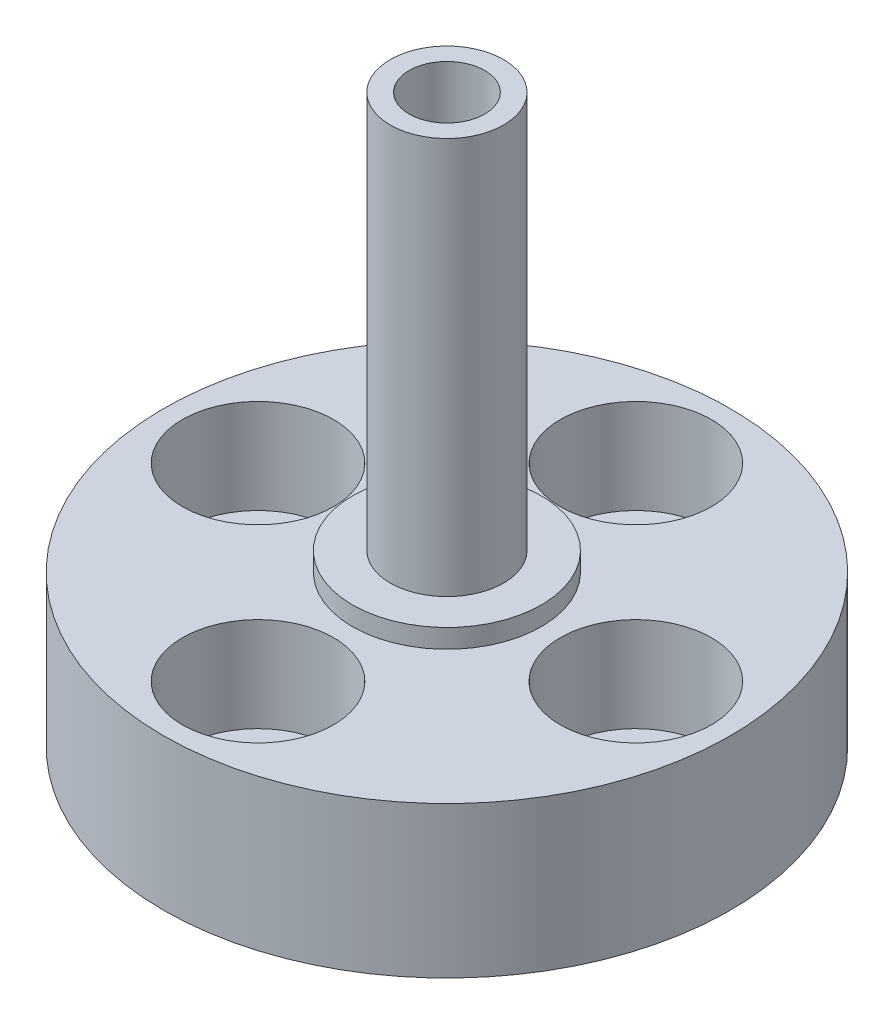
ISO-10303-21;
HEADER;
FILE_DESCRIPTION(('STEP AP214'),'2;1');
FILE_NAME('part.step','',(''),(''),'','','');
FILE_SCHEMA(('AUTOMOTIVE_DESIGN { 1 0 10303 214 1 1 1 1 }'));
ENDSEC;
DATA;
#1=APPLICATION_CONTEXT('core data for automotive mechanical design processes');
#2=APPLICATION_PROTOCOL_DEFINITION('international standard','automotive_design',2000,#1);
#3=PRODUCT_CONTEXT('',#1,'mechanical');
#4=PRODUCT('Part','Part','',(#3));
#5=PRODUCT_RELATED_PRODUCT_CATEGORY('part','',(#4));
#6=PRODUCT_DEFINITION_FORMATION('','',#4);
#7=PRODUCT_DEFINITION_CONTEXT('part definition',#1,'design');
#8=PRODUCT_DEFINITION('design','',#6,#7);
#9=PRODUCT_DEFINITION_SHAPE('','',#8);
#10=(LENGTH_UNIT() NAMED_UNIT(*) SI_UNIT(.MILLI.,.METRE.));
#11=(NAMED_UNIT(*) PLANE_ANGLE_UNIT() SI_UNIT($,.RADIAN.));
#12=(NAMED_UNIT(*) SI_UNIT($,.STERADIAN.) SOLID_ANGLE_UNIT());
#13=UNCERTAINTY_MEASURE_WITH_UNIT(LENGTH_MEASURE(1.E-05),#10,'distance_accuracy_value','');
#14=(GEOMETRIC_REPRESENTATION_CONTEXT(3) GLOBAL_UNCERTAINTY_ASSIGNED_CONTEXT((#13)) GLOBAL_UNIT_ASSIGNED_CONTEXT((#10,
#11,#12)) REPRESENTATION_CONTEXT('',''));
#15=CARTESIAN_POINT('',(0.,0.,0.));
#16=DIRECTION('',(0.,0.,1.));
#17=DIRECTION('',(1.,0.,0.));
#18=AXIS2_PLACEMENT_3D('',#15,#16,#17);
#19=CARTESIAN_POINT('',(0.,8.,0.));
#20=DIRECTION('',(0.,-1.,0.));
#21=DIRECTION('',(0.,0.,-1.));
#22=AXIS2_PLACEMENT_3D('',#19,#20,#21);
#23=CYLINDRICAL_SURFACE('',#22,15.);
#24=CARTESIAN_POINT('',(0.,8.,0.));
#25=DIRECTION('',(0.,1.,0.));
#26=DIRECTION('',(0.,0.,1.));
#27=AXIS2_PLACEMENT_3D('',#24,#25,#26);
#28=CIRCLE('',#27,15.);
#29=CARTESIAN_POINT('',(0.,8.,15.));
#30=VERTEX_POINT('',#29);
#31=EDGE_CURVE('E57',#30,#30,#28,.T.);
#32=ORIENTED_EDGE('',*,*,#31,.F.);
#33=EDGE_LOOP('',(#32));
#34=FACE_BOUND('',#33,.T.);
#35=CARTESIAN_POINT('',(0.,0.,0.));
#36=DIRECTION('',(0.,1.,0.));
#37=DIRECTION('',(0.,0.,1.));
#38=AXIS2_PLACEMENT_3D('',#35,#36,#37);
#39=CIRCLE('',#38,15.);
#40=CARTESIAN_POINT('',(0.,0.,15.));
#41=VERTEX_POINT('',#40);
#42=EDGE_CURVE('E46',#41,#41,#39,.T.);
#43=ORIENTED_EDGE('',*,*,#42,.T.);
#44=EDGE_LOOP('',(#43));
#45=FACE_BOUND('',#44,.T.);
#46=ADVANCED_FACE('F43',(#34,#45),#23,.T.);
#47=CARTESIAN_POINT('',(0.,8.,0.));
#48=DIRECTION('',(0.,1.,0.));
#49=DIRECTION('',(0.,0.,1.));
#50=AXIS2_PLACEMENT_3D('',#47,#48,#49);
#51=PLANE('',#50);
#52=CARTESIAN_POINT('',(-10.,8.,0.));
#53=DIRECTION('',(0.,1.,0.));
#54=DIRECTION('',(0.,0.,1.));
#55=AXIS2_PLACEMENT_3D('',#52,#53,#54);
#56=CIRCLE('',#55,4.00000000000001);
#57=CARTESIAN_POINT('',(-10.,8.,4.00000000000001));
#58=VERTEX_POINT('',#57);
#59=EDGE_CURVE('E287',#58,#58,#56,.T.);
#60=ORIENTED_EDGE('',*,*,#59,.F.);
#61=EDGE_LOOP('',(#60));
#62=FACE_BOUND('',#61,.T.);
#63=CARTESIAN_POINT('',(0.,8.,-10.));
#64=DIRECTION('',(0.,1.,0.));
#65=DIRECTION('',(0.,0.,1.));
#66=AXIS2_PLACEMENT_3D('',#63,#64,#65);
#67=CIRCLE('',#66,4.00000000000001);
#68=CARTESIAN_POINT('',(0.,8.,-5.99999999999999));
#69=VERTEX_POINT('',#68);
#70=EDGE_CURVE('E308',#69,#69,#67,.T.);
#71=ORIENTED_EDGE('',*,*,#70,.F.);
#72=EDGE_LOOP('',(#71));
#73=FACE_BOUND('',#72,.T.);
#74=CARTESIAN_POINT('',(10.,8.,0.));
#75=DIRECTION('',(0.,1.,0.));
#76=DIRECTION('',(0.,0.,1.));
#77=AXIS2_PLACEMENT_3D('',#74,#75,#76);
#78=CIRCLE('',#77,4.00000000000001);
#79=CARTESIAN_POINT('',(10.,8.,4.00000000000001));
#80=VERTEX_POINT('',#79);
#81=EDGE_CURVE('E324',#80,#80,#78,.T.);
#82=ORIENTED_EDGE('',*,*,#81,.F.);
#83=EDGE_LOOP('',(#82));
#84=FACE_BOUND('',#83,.T.);
#85=CARTESIAN_POINT('',(0.,8.,10.));
#86=DIRECTION('',(0.,1.,0.));
#87=DIRECTION('',(0.,0.,1.));
#88=AXIS2_PLACEMENT_3D('',#85,#86,#87);
#89=CIRCLE('',#88,4.00000000000001);
#90=CARTESIAN_POINT('',(0.,8.,14.));
#91=VERTEX_POINT('',#90);
#92=EDGE_CURVE('E340',#91,#91,#89,.T.);
#93=ORIENTED_EDGE('',*,*,#92,.F.);
#94=EDGE_LOOP('',(#93));
#95=FACE_BOUND('',#94,.T.);
#96=CARTESIAN_POINT('',(0.,8.,0.));
#97=DIRECTION('',(0.,1.,0.));
#98=DIRECTION('',(0.,0.,1.));
#99=AXIS2_PLACEMENT_3D('',#96,#97,#98);
#100=CIRCLE('',#99,5.);
#101=CARTESIAN_POINT('',(0.,8.,5.));
#102=VERTEX_POINT('',#101);
#103=EDGE_CURVE('E51',#102,#102,#100,.T.);
#104=ORIENTED_EDGE('',*,*,#103,.F.);
#105=EDGE_LOOP('',(#104));
#106=FACE_BOUND('',#105,.T.);
#107=ORIENTED_EDGE('',*,*,#31,.T.);
#108=EDGE_LOOP('',(#107));
#109=FACE_BOUND('',#108,.T.);
#110=ADVANCED_FACE('F78',(#62,#73,#84,#95,#106,#109),#51,.T.);
#111=CARTESIAN_POINT('',(0.,0.,0.));
#112=DIRECTION('',(0.,1.,0.));
#113=DIRECTION('',(0.,0.,1.));
#114=AXIS2_PLACEMENT_3D('',#111,#112,#113);
#115=PLANE('',#114);
#116=CARTESIAN_POINT('',(-10.,0.,0.));
#117=DIRECTION('',(0.,1.,0.));
#118=DIRECTION('',(0.,0.,1.));
#119=AXIS2_PLACEMENT_3D('',#116,#117,#118);
#120=CIRCLE('',#119,2.00000000000001);
#121=CARTESIAN_POINT('',(-10.,0.,2.00000000000001));
#122=VERTEX_POINT('',#121);
#123=EDGE_CURVE('E305',#122,#122,#120,.T.);
#124=ORIENTED_EDGE('',*,*,#123,.T.);
#125=EDGE_LOOP('',(#124));
#126=FACE_BOUND('',#125,.T.);
#127=CARTESIAN_POINT('',(0.,0.,-10.));
#128=DIRECTION('',(0.,1.,0.));
#129=DIRECTION('',(0.,0.,1.));
#130=AXIS2_PLACEMENT_3D('',#127,#128,#129);
#131=CIRCLE('',#130,2.00000000000001);
#132=CARTESIAN_POINT('',(0.,0.,-7.99999999999999));
#133=VERTEX_POINT('',#132);
#134=EDGE_CURVE('E320',#133,#133,#131,.T.);
#135=ORIENTED_EDGE('',*,*,#134,.T.);
#136=EDGE_LOOP('',(#135));
#137=FACE_BOUND('',#136,.T.);
#138=CARTESIAN_POINT('',(10.,0.,0.));
#139=DIRECTION('',(0.,1.,0.));
#140=DIRECTION('',(0.,0.,1.));
#141=AXIS2_PLACEMENT_3D('',#138,#139,#140);
#142=CIRCLE('',#141,2.00000000000001);
#143=CARTESIAN_POINT('',(10.,0.,2.00000000000001));
#144=VERTEX_POINT('',#143);
#145=EDGE_CURVE('E336',#144,#144,#142,.T.);
#146=ORIENTED_EDGE('',*,*,#145,.T.);
#147=EDGE_LOOP('',(#146));
#148=FACE_BOUND('',#147,.T.);
#149=CARTESIAN_POINT('',(0.,0.,10.));
#150=DIRECTION('',(0.,1.,0.));
#151=DIRECTION('',(0.,0.,1.));
#152=AXIS2_PLACEMENT_3D('',#149,#150,#151);
#153=CIRCLE('',#152,2.00000000000001);
#154=CARTESIAN_POINT('',(0.,0.,12.));
#155=VERTEX_POINT('',#154);
#156=EDGE_CURVE('E351',#155,#155,#153,.T.);
#157=ORIENTED_EDGE('',*,*,#156,.T.);
#158=EDGE_LOOP('',(#157));
#159=FACE_BOUND('',#158,.T.);
#160=ORIENTED_EDGE('',*,*,#42,.F.);
#161=EDGE_LOOP('',(#160));
#162=FACE_BOUND('',#161,.T.);
#163=ADVANCED_FACE('F75',(#126,#137,#148,#159,#162),#115,.F.);
#164=CARTESIAN_POINT('',(0.,9.,0.));
#165=DIRECTION('',(0.,-1.,0.));
#166=DIRECTION('',(0.,0.,-1.));
#167=AXIS2_PLACEMENT_3D('',#164,#165,#166);
#168=CYLINDRICAL_SURFACE('',#167,5.);
#169=CARTESIAN_POINT('',(0.,9.,0.));
#170=DIRECTION('',(0.,1.,0.));
#171=DIRECTION('',(0.,0.,1.));
#172=AXIS2_PLACEMENT_3D('',#169,#170,#171);
#173=CIRCLE('',#172,5.);
#174=CARTESIAN_POINT('',(0.,9.,5.));
#175=VERTEX_POINT('',#174);
#176=EDGE_CURVE('E63',#175,#175,#173,.T.);
#177=ORIENTED_EDGE('',*,*,#176,.F.);
#178=EDGE_LOOP('',(#177));
#179=FACE_BOUND('',#178,.T.);
#180=ORIENTED_EDGE('',*,*,#103,.T.);
#181=EDGE_LOOP('',(#180));
#182=FACE_BOUND('',#181,.T.);
#183=ADVANCED_FACE('F77',(#179,#182),#168,.T.);
#184=CARTESIAN_POINT('',(0.,9.,0.));
#185=DIRECTION('',(0.,1.,0.));
#186=DIRECTION('',(0.,0.,1.));
#187=AXIS2_PLACEMENT_3D('',#184,#185,#186);
#188=PLANE('',#187);
#189=CARTESIAN_POINT('',(0.,9.,0.));
#190=DIRECTION('',(0.,1.,0.));
#191=DIRECTION('',(0.,0.,1.));
#192=AXIS2_PLACEMENT_3D('',#189,#190,#191);
#193=CIRCLE('',#192,3.);
#194=CARTESIAN_POINT('',(0.,9.,3.));
#195=VERTEX_POINT('',#194);
#196=EDGE_CURVE('E10',#195,#195,#193,.T.);
#197=ORIENTED_EDGE('',*,*,#196,.F.);
#198=EDGE_LOOP('',(#197));
#199=FACE_BOUND('',#198,.T.);
#200=ORIENTED_EDGE('',*,*,#176,.T.);
#201=EDGE_LOOP('',(#200));
#202=FACE_BOUND('',#201,.T.);
#203=ADVANCED_FACE('F85',(#199,#202),#188,.T.);
#204=CARTESIAN_POINT('',(0.,30.,0.));
#205=DIRECTION('',(0.,-1.,0.));
#206=DIRECTION('',(0.,0.,-1.));
#207=AXIS2_PLACEMENT_3D('',#204,#205,#206);
#208=CYLINDRICAL_SURFACE('',#207,3.);
#209=CARTESIAN_POINT('',(0.,30.,0.));
#210=DIRECTION('',(0.,1.,0.));
#211=DIRECTION('',(0.,0.,1.));
#212=AXIS2_PLACEMENT_3D('',#209,#210,#211);
#213=CIRCLE('',#212,3.);
#214=CARTESIAN_POINT('',(0.,30.,3.));
#215=VERTEX_POINT('',#214);
#216=EDGE_CURVE('E61',#215,#215,#213,.T.);
#217=ORIENTED_EDGE('',*,*,#216,.F.);
#218=EDGE_LOOP('',(#217));
#219=FACE_BOUND('',#218,.T.);
#220=ORIENTED_EDGE('',*,*,#196,.T.);
#221=EDGE_LOOP('',(#220));
#222=FACE_BOUND('',#221,.T.);
#223=ADVANCED_FACE('F109',(#219,#222),#208,.T.);
#224=CARTESIAN_POINT('',(0.,30.,0.));
#225=DIRECTION('',(0.,1.,0.));
#226=DIRECTION('',(0.,0.,1.));
#227=AXIS2_PLACEMENT_3D('',#224,#225,#226);
#228=PLANE('',#227);
#229=CARTESIAN_POINT('',(0.,30.,0.));
#230=DIRECTION('',(0.,1.,0.));
#231=DIRECTION('',(0.,0.,1.));
#232=AXIS2_PLACEMENT_3D('',#229,#230,#231);
#233=CIRCLE('',#232,2.);
#234=CARTESIAN_POINT('',(0.,30.,2.));
#235=VERTEX_POINT('',#234);
#236=EDGE_CURVE('E288',#235,#235,#233,.T.);
#237=ORIENTED_EDGE('',*,*,#236,.F.);
#238=EDGE_LOOP('',(#237));
#239=FACE_BOUND('',#238,.T.);
#240=ORIENTED_EDGE('',*,*,#216,.T.);
#241=EDGE_LOOP('',(#240));
#242=FACE_BOUND('',#241,.T.);
#243=ADVANCED_FACE('F117',(#239,#242),#228,.T.);
#244=CARTESIAN_POINT('',(0.,8.,10.));
#245=DIRECTION('',(0.,1.,0.));
#246=DIRECTION('',(0.,0.,1.));
#247=AXIS2_PLACEMENT_3D('',#244,#245,#246);
#248=CYLINDRICAL_SURFACE('',#247,2.00000000000001);
#249=ORIENTED_EDGE('',*,*,#156,.F.);
#250=EDGE_LOOP('',(#249));
#251=FACE_BOUND('',#250,.T.);
#252=CARTESIAN_POINT('',(0.,3.,10.));
#253=DIRECTION('',(0.,1.,0.));
#254=DIRECTION('',(0.,0.,1.));
#255=AXIS2_PLACEMENT_3D('',#252,#253,#254);
#256=CIRCLE('',#255,2.00000000000001);
#257=CARTESIAN_POINT('',(0.,3.,12.));
#258=VERTEX_POINT('',#257);
#259=EDGE_CURVE('E348',#258,#258,#256,.T.);
#260=ORIENTED_EDGE('',*,*,#259,.T.);
#261=EDGE_LOOP('',(#260));
#262=FACE_BOUND('',#261,.T.);
#263=ADVANCED_FACE('F140',(#251,#262),#248,.F.);
#264=CARTESIAN_POINT('',(2.00000000000001,3.,10.));
#265=DIRECTION('',(0.,-1.,0.));
#266=DIRECTION('',(0.,0.,-1.));
#267=AXIS2_PLACEMENT_3D('',#264,#265,#266);
#268=PLANE('',#267);
#269=ORIENTED_EDGE('',*,*,#259,.F.);
#270=EDGE_LOOP('',(#269));
#271=FACE_BOUND('',#270,.T.);
#272=CARTESIAN_POINT('',(0.,3.,10.));
#273=DIRECTION('',(0.,1.,0.));
#274=DIRECTION('',(0.,0.,1.));
#275=AXIS2_PLACEMENT_3D('',#272,#273,#274);
#276=CIRCLE('',#275,4.00000000000001);
#277=CARTESIAN_POINT('',(0.,3.,14.));
#278=VERTEX_POINT('',#277);
#279=EDGE_CURVE('E344',#278,#278,#276,.T.);
#280=ORIENTED_EDGE('',*,*,#279,.T.);
#281=EDGE_LOOP('',(#280));
#282=FACE_BOUND('',#281,.T.);
#283=ADVANCED_FACE('F148',(#271,#282),#268,.F.);
#284=CARTESIAN_POINT('',(0.,8.,10.));
#285=DIRECTION('',(0.,1.,0.));
#286=DIRECTION('',(0.,0.,1.));
#287=AXIS2_PLACEMENT_3D('',#284,#285,#286);
#288=CYLINDRICAL_SURFACE('',#287,4.00000000000001);
#289=ORIENTED_EDGE('',*,*,#279,.F.);
#290=EDGE_LOOP('',(#289));
#291=FACE_BOUND('',#290,.T.);
#292=ORIENTED_EDGE('',*,*,#92,.T.);
#293=EDGE_LOOP('',(#292));
#294=FACE_BOUND('',#293,.T.);
#295=ADVANCED_FACE('F157',(#291,#294),#288,.F.);
#296=CARTESIAN_POINT('',(10.,8.,0.));
#297=DIRECTION('',(0.,1.,0.));
#298=DIRECTION('',(0.,0.,1.));
#299=AXIS2_PLACEMENT_3D('',#296,#297,#298);
#300=CYLINDRICAL_SURFACE('',#299,2.00000000000001);
#301=ORIENTED_EDGE('',*,*,#145,.F.);
#302=EDGE_LOOP('',(#301));
#303=FACE_BOUND('',#302,.T.);
#304=CARTESIAN_POINT('',(10.,3.,0.));
#305=DIRECTION('',(0.,1.,0.));
#306=DIRECTION('',(0.,0.,1.));
#307=AXIS2_PLACEMENT_3D('',#304,#305,#306);
#308=CIRCLE('',#307,2.00000000000001);
#309=CARTESIAN_POINT('',(10.,3.,2.00000000000001));
#310=VERTEX_POINT('',#309);
#311=EDGE_CURVE('E332',#310,#310,#308,.T.);
#312=ORIENTED_EDGE('',*,*,#311,.T.);
#313=EDGE_LOOP('',(#312));
#314=FACE_BOUND('',#313,.T.);
#315=ADVANCED_FACE('F166',(#303,#314),#300,.F.);
#316=CARTESIAN_POINT('',(12.,3.,0.));
#317=DIRECTION('',(0.,-1.,0.));
#318=DIRECTION('',(0.,0.,-1.));
#319=AXIS2_PLACEMENT_3D('',#316,#317,#318);
#320=PLANE('',#319);
#321=ORIENTED_EDGE('',*,*,#311,.F.);
#322=EDGE_LOOP('',(#321));
#323=FACE_BOUND('',#322,.T.);
#324=CARTESIAN_POINT('',(10.,3.,0.));
#325=DIRECTION('',(0.,1.,0.));
#326=DIRECTION('',(0.,0.,1.));
#327=AXIS2_PLACEMENT_3D('',#324,#325,#326);
#328=CIRCLE('',#327,4.00000000000001);
#329=CARTESIAN_POINT('',(10.,3.,4.00000000000001));
#330=VERTEX_POINT('',#329);
#331=EDGE_CURVE('E328',#330,#330,#328,.T.);
#332=ORIENTED_EDGE('',*,*,#331,.T.);
#333=EDGE_LOOP('',(#332));
#334=FACE_BOUND('',#333,.T.);
#335=ADVANCED_FACE('F175',(#323,#334),#320,.F.);
#336=CARTESIAN_POINT('',(10.,8.,0.));
#337=DIRECTION('',(0.,1.,0.));
#338=DIRECTION('',(0.,0.,1.));
#339=AXIS2_PLACEMENT_3D('',#336,#337,#338);
#340=CYLINDRICAL_SURFACE('',#339,4.00000000000001);
#341=ORIENTED_EDGE('',*,*,#331,.F.);
#342=EDGE_LOOP('',(#341));
#343=FACE_BOUND('',#342,.T.);
#344=ORIENTED_EDGE('',*,*,#81,.T.);
#345=EDGE_LOOP('',(#344));
#346=FACE_BOUND('',#345,.T.);
#347=ADVANCED_FACE('F184',(#343,#346),#340,.F.);
#348=CARTESIAN_POINT('',(0.,8.,-10.));
#349=DIRECTION('',(0.,1.,0.));
#350=DIRECTION('',(0.,0.,1.));
#351=AXIS2_PLACEMENT_3D('',#348,#349,#350);
#352=CYLINDRICAL_SURFACE('',#351,2.00000000000001);
#353=ORIENTED_EDGE('',*,*,#134,.F.);
#354=EDGE_LOOP('',(#353));
#355=FACE_BOUND('',#354,.T.);
#356=CARTESIAN_POINT('',(0.,3.,-10.));
#357=DIRECTION('',(0.,1.,0.));
#358=DIRECTION('',(0.,0.,1.));
#359=AXIS2_PLACEMENT_3D('',#356,#357,#358);
#360=CIRCLE('',#359,2.00000000000001);
#361=CARTESIAN_POINT('',(0.,3.,-7.99999999999999));
#362=VERTEX_POINT('',#361);
#363=EDGE_CURVE('E316',#362,#362,#360,.T.);
#364=ORIENTED_EDGE('',*,*,#363,.T.);
#365=EDGE_LOOP('',(#364));
#366=FACE_BOUND('',#365,.T.);
#367=ADVANCED_FACE('F193',(#355,#366),#352,.F.);
#368=CARTESIAN_POINT('',(2.00000000000001,3.,-10.));
#369=DIRECTION('',(0.,-1.,0.));
#370=DIRECTION('',(0.,0.,-1.));
#371=AXIS2_PLACEMENT_3D('',#368,#369,#370);
#372=PLANE('',#371);
#373=ORIENTED_EDGE('',*,*,#363,.F.);
#374=EDGE_LOOP('',(#373));
#375=FACE_BOUND('',#374,.T.);
#376=CARTESIAN_POINT('',(0.,3.,-10.));
#377=DIRECTION('',(0.,1.,0.));
#378=DIRECTION('',(0.,0.,1.));
#379=AXIS2_PLACEMENT_3D('',#376,#377,#378);
#380=CIRCLE('',#379,4.00000000000001);
#381=CARTESIAN_POINT('',(0.,3.,-5.99999999999999));
#382=VERTEX_POINT('',#381);
#383=EDGE_CURVE('E312',#382,#382,#380,.T.);
#384=ORIENTED_EDGE('',*,*,#383,.T.);
#385=EDGE_LOOP('',(#384));
#386=FACE_BOUND('',#385,.T.);
#387=ADVANCED_FACE('F202',(#375,#386),#372,.F.);
#388=CARTESIAN_POINT('',(0.,8.,-10.));
#389=DIRECTION('',(0.,1.,0.));
#390=DIRECTION('',(0.,0.,1.));
#391=AXIS2_PLACEMENT_3D('',#388,#389,#390);
#392=CYLINDRICAL_SURFACE('',#391,4.00000000000001);
#393=ORIENTED_EDGE('',*,*,#383,.F.);
#394=EDGE_LOOP('',(#393));
#395=FACE_BOUND('',#394,.T.);
#396=ORIENTED_EDGE('',*,*,#70,.T.);
#397=EDGE_LOOP('',(#396));
#398=FACE_BOUND('',#397,.T.);
#399=ADVANCED_FACE('F211',(#395,#398),#392,.F.);
#400=CARTESIAN_POINT('',(-10.,8.,0.));
#401=DIRECTION('',(0.,1.,0.));
#402=DIRECTION('',(0.,0.,1.));
#403=AXIS2_PLACEMENT_3D('',#400,#401,#402);
#404=CYLINDRICAL_SURFACE('',#403,2.00000000000001);
#405=ORIENTED_EDGE('',*,*,#123,.F.);
#406=EDGE_LOOP('',(#405));
#407=FACE_BOUND('',#406,.T.);
#408=CARTESIAN_POINT('',(-10.,3.,0.));
#409=DIRECTION('',(0.,1.,0.));
#410=DIRECTION('',(0.,0.,1.));
#411=AXIS2_PLACEMENT_3D('',#408,#409,#410);
#412=CIRCLE('',#411,2.00000000000001);
#413=CARTESIAN_POINT('',(-10.,3.,2.00000000000001));
#414=VERTEX_POINT('',#413);
#415=EDGE_CURVE('E301',#414,#414,#412,.T.);
#416=ORIENTED_EDGE('',*,*,#415,.T.);
#417=EDGE_LOOP('',(#416));
#418=FACE_BOUND('',#417,.T.);
#419=ADVANCED_FACE('F220',(#407,#418),#404,.F.);
#420=CARTESIAN_POINT('',(-7.99999999999999,3.,0.));
#421=DIRECTION('',(0.,-1.,0.));
#422=DIRECTION('',(0.,0.,-1.));
#423=AXIS2_PLACEMENT_3D('',#420,#421,#422);
#424=PLANE('',#423);
#425=ORIENTED_EDGE('',*,*,#415,.F.);
#426=EDGE_LOOP('',(#425));
#427=FACE_BOUND('',#426,.T.);
#428=CARTESIAN_POINT('',(-10.,3.,0.));
#429=DIRECTION('',(0.,1.,0.));
#430=DIRECTION('',(0.,0.,1.));
#431=AXIS2_PLACEMENT_3D('',#428,#429,#430);
#432=CIRCLE('',#431,4.00000000000001);
#433=CARTESIAN_POINT('',(-10.,3.,4.00000000000001));
#434=VERTEX_POINT('',#433);
#435=EDGE_CURVE('E293',#434,#434,#432,.T.);
#436=ORIENTED_EDGE('',*,*,#435,.T.);
#437=EDGE_LOOP('',(#436));
#438=FACE_BOUND('',#437,.T.);
#439=ADVANCED_FACE('F229',(#427,#438),#424,.F.);
#440=CARTESIAN_POINT('',(-10.,8.,0.));
#441=DIRECTION('',(0.,1.,0.));
#442=DIRECTION('',(0.,0.,1.));
#443=AXIS2_PLACEMENT_3D('',#440,#441,#442);
#444=CYLINDRICAL_SURFACE('',#443,4.00000000000001);
#445=ORIENTED_EDGE('',*,*,#435,.F.);
#446=EDGE_LOOP('',(#445));
#447=FACE_BOUND('',#446,.T.);
#448=ORIENTED_EDGE('',*,*,#59,.T.);
#449=EDGE_LOOP('',(#448));
#450=FACE_BOUND('',#449,.T.);
#451=ADVANCED_FACE('F238',(#447,#450),#444,.F.);
#452=CARTESIAN_POINT('',(0.,18.,0.));
#453=DIRECTION('',(0.,1.,0.));
#454=DIRECTION('',(0.,0.,1.));
#455=AXIS2_PLACEMENT_3D('',#452,#453,#454);
#456=CYLINDRICAL_SURFACE('',#455,2.);
#457=CARTESIAN_POINT('',(0.,18.,0.));
#458=DIRECTION('',(0.,1.,0.));
#459=DIRECTION('',(0.,0.,1.));
#460=AXIS2_PLACEMENT_3D('',#457,#458,#459);
#461=CIRCLE('',#460,2.);
#462=CARTESIAN_POINT('',(0.,18.,2.));
#463=VERTEX_POINT('',#462);
#464=EDGE_CURVE('E285',#463,#463,#461,.T.);
#465=ORIENTED_EDGE('',*,*,#464,.F.);
#466=EDGE_LOOP('',(#465));
#467=FACE_BOUND('',#466,.T.);
#468=ORIENTED_EDGE('',*,*,#236,.T.);
#469=EDGE_LOOP('',(#468));
#470=FACE_BOUND('',#469,.T.);
#471=ADVANCED_FACE('F247',(#467,#470),#456,.F.);
#472=CARTESIAN_POINT('',(0.,18.,0.));
#473=DIRECTION('',(0.,1.,0.));
#474=DIRECTION('',(0.,0.,1.));
#475=AXIS2_PLACEMENT_3D('',#472,#473,#474);
#476=PLANE('',#475);
#477=ORIENTED_EDGE('',*,*,#464,.T.);
#478=EDGE_LOOP('',(#477));
#479=FACE_BOUND('',#478,.T.);
#480=ADVANCED_FACE('F256',(#479),#476,.T.);
#481=CLOSED_SHELL('',(#46,#110,#163,#183,#203,#223,#243,#263,#283,#295,#315,#335,#347,#367,#387,
#399,#419,#439,#451,#471,#480));
#482=MANIFOLD_SOLID_BREP('B2',#481);
#483=ADVANCED_BREP_SHAPE_REPRESENTATION('',(#18,#482),#14);
#484=SHAPE_DEFINITION_REPRESENTATION(#9,#483);
ENDSEC;
END-ISO-10303-21;
